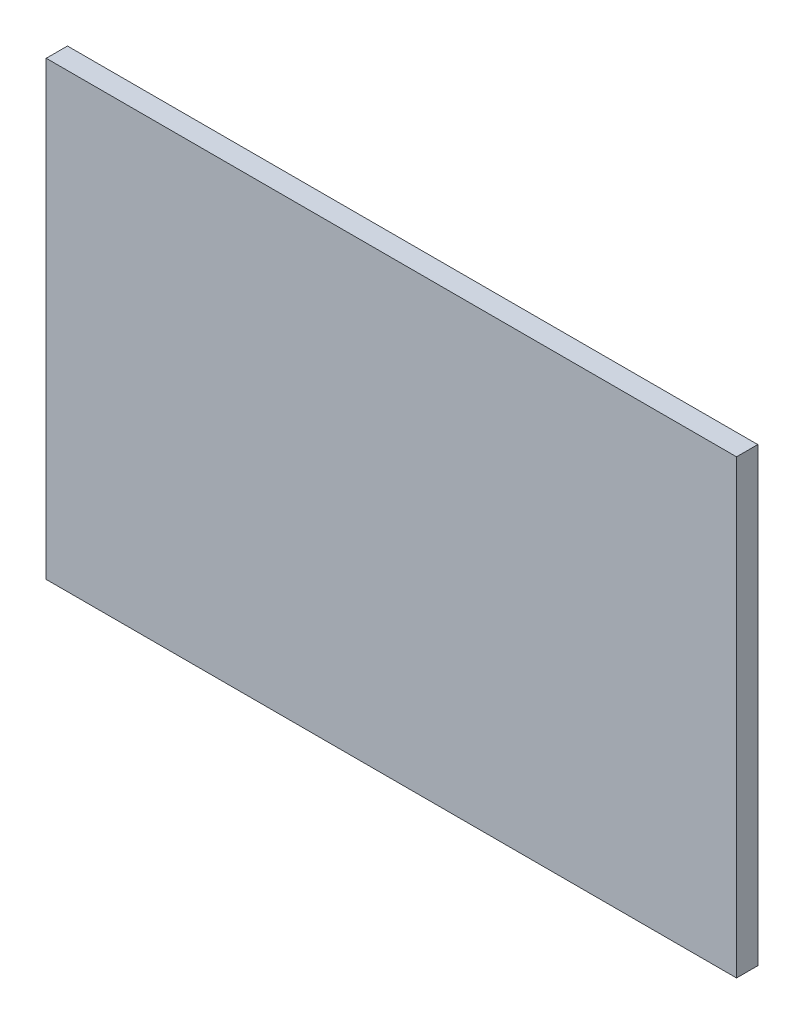
ISO-10303-21;
HEADER;
FILE_DESCRIPTION(('STEP AP214'),'2;1');
FILE_NAME('part.step','',(''),(''),'','','');
FILE_SCHEMA(('AUTOMOTIVE_DESIGN { 1 0 10303 214 1 1 1 1 }'));
ENDSEC;
DATA;
#1=APPLICATION_CONTEXT('core data for automotive mechanical design processes');
#2=APPLICATION_PROTOCOL_DEFINITION('international standard','automotive_design',2000,#1);
#3=PRODUCT_CONTEXT('',#1,'mechanical');
#4=PRODUCT('Part','Part','',(#3));
#5=PRODUCT_RELATED_PRODUCT_CATEGORY('part','',(#4));
#6=PRODUCT_DEFINITION_FORMATION('','',#4);
#7=PRODUCT_DEFINITION_CONTEXT('part definition',#1,'design');
#8=PRODUCT_DEFINITION('design','',#6,#7);
#9=PRODUCT_DEFINITION_SHAPE('','',#8);
#10=(LENGTH_UNIT() NAMED_UNIT(*) SI_UNIT(.MILLI.,.METRE.));
#11=(NAMED_UNIT(*) PLANE_ANGLE_UNIT() SI_UNIT($,.RADIAN.));
#12=(NAMED_UNIT(*) SI_UNIT($,.STERADIAN.) SOLID_ANGLE_UNIT());
#13=UNCERTAINTY_MEASURE_WITH_UNIT(LENGTH_MEASURE(1.E-05),#10,'distance_accuracy_value','');
#14=(GEOMETRIC_REPRESENTATION_CONTEXT(3) GLOBAL_UNCERTAINTY_ASSIGNED_CONTEXT((#13)) GLOBAL_UNIT_ASSIGNED_CONTEXT((#10,
#11,#12)) REPRESENTATION_CONTEXT('',''));
#15=CARTESIAN_POINT('',(0.,0.,0.));
#16=DIRECTION('',(0.,0.,1.));
#17=DIRECTION('',(1.,0.,0.));
#18=AXIS2_PLACEMENT_3D('',#15,#16,#17);
#19=CARTESIAN_POINT('',(0.,0.,0.8));
#20=DIRECTION('',(1.,0.,0.));
#21=DIRECTION('',(0.,1.,0.));
#22=AXIS2_PLACEMENT_3D('',#19,#20,#21);
#23=PLANE('',#22);
#24=DIRECTION('',(0.,-1.,0.));
#25=VECTOR('',#24,1.);
#26=CARTESIAN_POINT('',(0.,0.,0.));
#27=LINE('',#26,#25);
#28=CARTESIAN_POINT('',(0.,0.,0.));
#29=VERTEX_POINT('',#28);
#30=CARTESIAN_POINT('',(0.,-17.,0.));
#31=VERTEX_POINT('',#30);
#32=EDGE_CURVE('E99',#29,#31,#27,.T.);
#33=ORIENTED_EDGE('',*,*,#32,.T.);
#34=DIRECTION('',(0.,0.,-1.));
#35=VECTOR('',#34,1.);
#36=CARTESIAN_POINT('',(0.,-17.,0.8));
#37=LINE('',#36,#35);
#38=CARTESIAN_POINT('',(0.,-17.,0.8));
#39=VERTEX_POINT('',#38);
#40=EDGE_CURVE('E11',#39,#31,#37,.T.);
#41=ORIENTED_EDGE('',*,*,#40,.F.);
#42=DIRECTION('',(0.,-1.,0.));
#43=VECTOR('',#42,1.);
#44=CARTESIAN_POINT('',(0.,0.,0.8));
#45=LINE('',#44,#43);
#46=CARTESIAN_POINT('',(0.,0.,0.8));
#47=VERTEX_POINT('',#46);
#48=EDGE_CURVE('E87',#47,#39,#45,.T.);
#49=ORIENTED_EDGE('',*,*,#48,.F.);
#50=DIRECTION('',(0.,0.,-1.));
#51=VECTOR('',#50,1.);
#52=CARTESIAN_POINT('',(0.,0.,0.8));
#53=LINE('',#52,#51);
#54=EDGE_CURVE('E95',#47,#29,#53,.T.);
#55=ORIENTED_EDGE('',*,*,#54,.T.);
#56=EDGE_LOOP('',(#33,#41,#49,#55));
#57=FACE_BOUND('',#56,.T.);
#58=ADVANCED_FACE('F36',(#57),#23,.F.);
#59=CARTESIAN_POINT('',(0.,-17.,0.8));
#60=DIRECTION('',(0.,1.,0.));
#61=DIRECTION('',(0.,0.,1.));
#62=AXIS2_PLACEMENT_3D('',#59,#60,#61);
#63=PLANE('',#62);
#64=DIRECTION('',(1.,0.,0.));
#65=VECTOR('',#64,1.);
#66=CARTESIAN_POINT('',(0.,-17.,0.));
#67=LINE('',#66,#65);
#68=CARTESIAN_POINT('',(26.,-17.,0.));
#69=VERTEX_POINT('',#68);
#70=EDGE_CURVE('E91',#31,#69,#67,.T.);
#71=ORIENTED_EDGE('',*,*,#70,.T.);
#72=DIRECTION('',(0.,0.,-1.));
#73=VECTOR('',#72,1.);
#74=CARTESIAN_POINT('',(26.,-17.,0.8));
#75=LINE('',#74,#73);
#76=CARTESIAN_POINT('',(26.,-17.,0.8));
#77=VERTEX_POINT('',#76);
#78=EDGE_CURVE('E44',#77,#69,#75,.T.);
#79=ORIENTED_EDGE('',*,*,#78,.F.);
#80=DIRECTION('',(1.,0.,0.));
#81=VECTOR('',#80,1.);
#82=CARTESIAN_POINT('',(0.,-17.,0.8));
#83=LINE('',#82,#81);
#84=EDGE_CURVE('E82',#39,#77,#83,.T.);
#85=ORIENTED_EDGE('',*,*,#84,.F.);
#86=ORIENTED_EDGE('',*,*,#40,.T.);
#87=EDGE_LOOP('',(#71,#79,#85,#86));
#88=FACE_BOUND('',#87,.T.);
#89=ADVANCED_FACE('F90',(#88),#63,.F.);
#90=CARTESIAN_POINT('',(26.,0.,0.8));
#91=DIRECTION('',(-1.,0.,0.));
#92=DIRECTION('',(0.,-1.,0.));
#93=AXIS2_PLACEMENT_3D('',#90,#91,#92);
#94=PLANE('',#93);
#95=DIRECTION('',(0.,1.,0.));
#96=VECTOR('',#95,1.);
#97=CARTESIAN_POINT('',(26.,0.,0.));
#98=LINE('',#97,#96);
#99=CARTESIAN_POINT('',(26.,0.,0.));
#100=VERTEX_POINT('',#99);
#101=EDGE_CURVE('E69',#69,#100,#98,.T.);
#102=ORIENTED_EDGE('',*,*,#101,.T.);
#103=DIRECTION('',(0.,0.,-1.));
#104=VECTOR('',#103,1.);
#105=CARTESIAN_POINT('',(26.,0.,0.8));
#106=LINE('',#105,#104);
#107=CARTESIAN_POINT('',(26.,0.,0.8));
#108=VERTEX_POINT('',#107);
#109=EDGE_CURVE('E92',#108,#100,#106,.T.);
#110=ORIENTED_EDGE('',*,*,#109,.F.);
#111=DIRECTION('',(0.,1.,0.));
#112=VECTOR('',#111,1.);
#113=CARTESIAN_POINT('',(26.,0.,0.8));
#114=LINE('',#113,#112);
#115=EDGE_CURVE('E85',#77,#108,#114,.T.);
#116=ORIENTED_EDGE('',*,*,#115,.F.);
#117=ORIENTED_EDGE('',*,*,#78,.T.);
#118=EDGE_LOOP('',(#102,#110,#116,#117));
#119=FACE_BOUND('',#118,.T.);
#120=ADVANCED_FACE('F93',(#119),#94,.F.);
#121=CARTESIAN_POINT('',(0.,0.,0.8));
#122=DIRECTION('',(0.,-1.,0.));
#123=DIRECTION('',(0.,0.,-1.));
#124=AXIS2_PLACEMENT_3D('',#121,#122,#123);
#125=PLANE('',#124);
#126=DIRECTION('',(-1.,0.,0.));
#127=VECTOR('',#126,1.);
#128=CARTESIAN_POINT('',(0.,0.,0.));
#129=LINE('',#128,#127);
#130=EDGE_CURVE('E75',#100,#29,#129,.T.);
#131=ORIENTED_EDGE('',*,*,#130,.T.);
#132=ORIENTED_EDGE('',*,*,#54,.F.);
#133=DIRECTION('',(-1.,0.,0.));
#134=VECTOR('',#133,1.);
#135=CARTESIAN_POINT('',(0.,0.,0.8));
#136=LINE('',#135,#134);
#137=EDGE_CURVE('E52',#108,#47,#136,.T.);
#138=ORIENTED_EDGE('',*,*,#137,.F.);
#139=ORIENTED_EDGE('',*,*,#109,.T.);
#140=EDGE_LOOP('',(#131,#132,#138,#139));
#141=FACE_BOUND('',#140,.T.);
#142=ADVANCED_FACE('F106',(#141),#125,.F.);
#143=CARTESIAN_POINT('',(0.,0.,0.8));
#144=DIRECTION('',(0.,0.,1.));
#145=DIRECTION('',(1.,0.,0.));
#146=AXIS2_PLACEMENT_3D('',#143,#144,#145);
#147=PLANE('',#146);
#148=ORIENTED_EDGE('',*,*,#48,.T.);
#149=ORIENTED_EDGE('',*,*,#84,.T.);
#150=ORIENTED_EDGE('',*,*,#115,.T.);
#151=ORIENTED_EDGE('',*,*,#137,.T.);
#152=EDGE_LOOP('',(#148,#149,#150,#151));
#153=FACE_BOUND('',#152,.T.);
#154=ADVANCED_FACE('F83',(#153),#147,.T.);
#155=CARTESIAN_POINT('',(0.,0.,0.));
#156=DIRECTION('',(0.,0.,1.));
#157=DIRECTION('',(1.,0.,0.));
#158=AXIS2_PLACEMENT_3D('',#155,#156,#157);
#159=PLANE('',#158);
#160=ORIENTED_EDGE('',*,*,#32,.F.);
#161=ORIENTED_EDGE('',*,*,#130,.F.);
#162=ORIENTED_EDGE('',*,*,#101,.F.);
#163=ORIENTED_EDGE('',*,*,#70,.F.);
#164=EDGE_LOOP('',(#160,#161,#162,#163));
#165=FACE_BOUND('',#164,.T.);
#166=ADVANCED_FACE('F109',(#165),#159,.F.);
#167=CLOSED_SHELL('',(#58,#89,#120,#142,#154,#166));
#168=MANIFOLD_SOLID_BREP('B2',#167);
#169=ADVANCED_BREP_SHAPE_REPRESENTATION('',(#18,#168),#14);
#170=SHAPE_DEFINITION_REPRESENTATION(#9,#169);
ENDSEC;
END-ISO-10303-21;
